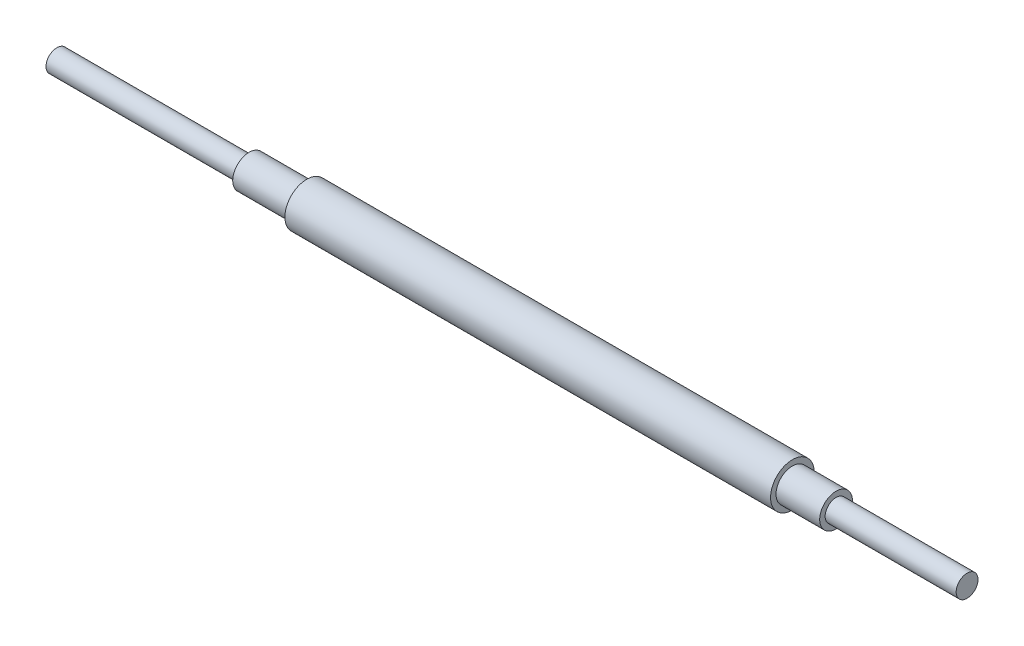
ISO-10303-21;
HEADER;
FILE_DESCRIPTION(('STEP AP214'),'2;1');
FILE_NAME('part.step','',(''),(''),'','','');
FILE_SCHEMA(('AUTOMOTIVE_DESIGN { 1 0 10303 214 1 1 1 1 }'));
ENDSEC;
DATA;
#1=APPLICATION_CONTEXT('core data for automotive mechanical design processes');
#2=APPLICATION_PROTOCOL_DEFINITION('international standard','automotive_design',2000,#1);
#3=PRODUCT_CONTEXT('',#1,'mechanical');
#4=PRODUCT('Part','Part','',(#3));
#5=PRODUCT_RELATED_PRODUCT_CATEGORY('part','',(#4));
#6=PRODUCT_DEFINITION_FORMATION('','',#4);
#7=PRODUCT_DEFINITION_CONTEXT('part definition',#1,'design');
#8=PRODUCT_DEFINITION('design','',#6,#7);
#9=PRODUCT_DEFINITION_SHAPE('','',#8);
#10=(LENGTH_UNIT() NAMED_UNIT(*) SI_UNIT(.MILLI.,.METRE.));
#11=(NAMED_UNIT(*) PLANE_ANGLE_UNIT() SI_UNIT($,.RADIAN.));
#12=(NAMED_UNIT(*) SI_UNIT($,.STERADIAN.) SOLID_ANGLE_UNIT());
#13=UNCERTAINTY_MEASURE_WITH_UNIT(LENGTH_MEASURE(1.E-05),#10,'distance_accuracy_value','');
#14=(GEOMETRIC_REPRESENTATION_CONTEXT(3) GLOBAL_UNCERTAINTY_ASSIGNED_CONTEXT((#13)) GLOBAL_UNIT_ASSIGNED_CONTEXT((#10,
#11,#12)) REPRESENTATION_CONTEXT('',''));
#15=CARTESIAN_POINT('',(0.,0.,0.));
#16=DIRECTION('',(0.,0.,1.));
#17=DIRECTION('',(1.,0.,0.));
#18=AXIS2_PLACEMENT_3D('',#15,#16,#17);
#19=CARTESIAN_POINT('',(-264.055553454714,3.17499999999999,0.));
#20=DIRECTION('',(1.,0.,0.));
#21=DIRECTION('',(0.,1.,0.));
#22=AXIS2_PLACEMENT_3D('',#19,#20,#21);
#23=PLANE('',#22);
#24=CARTESIAN_POINT('',(-264.055553454714,0.,0.));
#25=DIRECTION('',(-1.,0.,0.));
#26=DIRECTION('',(0.,-1.,0.));
#27=AXIS2_PLACEMENT_3D('',#24,#25,#26);
#28=CIRCLE('',#27,3.17499999999999);
#29=CARTESIAN_POINT('',(-264.055553454714,-3.17499999999999,0.));
#30=VERTEX_POINT('',#29);
#31=EDGE_CURVE('E10',#30,#30,#28,.T.);
#32=ORIENTED_EDGE('',*,*,#31,.T.);
#33=EDGE_LOOP('',(#32));
#34=FACE_BOUND('',#33,.T.);
#35=ADVANCED_FACE('F41',(#34),#23,.F.);
#36=CARTESIAN_POINT('',(-264.055553454714,0.,0.));
#37=DIRECTION('',(-1.,0.,0.));
#38=DIRECTION('',(0.,-1.,0.));
#39=AXIS2_PLACEMENT_3D('',#36,#37,#38);
#40=CYLINDRICAL_SURFACE('',#39,3.175);
#41=ORIENTED_EDGE('',*,*,#31,.F.);
#42=EDGE_LOOP('',(#41));
#43=FACE_BOUND('',#42,.T.);
#44=CARTESIAN_POINT('',(-208.175553454714,0.,0.));
#45=DIRECTION('',(-1.,0.,0.));
#46=DIRECTION('',(0.,-1.,0.));
#47=AXIS2_PLACEMENT_3D('',#44,#45,#46);
#48=CIRCLE('',#47,3.175);
#49=CARTESIAN_POINT('',(-208.175553454714,-3.175,0.));
#50=VERTEX_POINT('',#49);
#51=EDGE_CURVE('E48',#50,#50,#48,.T.);
#52=ORIENTED_EDGE('',*,*,#51,.T.);
#53=EDGE_LOOP('',(#52));
#54=FACE_BOUND('',#53,.T.);
#55=ADVANCED_FACE('F107',(#43,#54),#40,.T.);
#56=CARTESIAN_POINT('',(-208.175553454714,4.76249999999998,0.));
#57=DIRECTION('',(1.,0.,0.));
#58=DIRECTION('',(0.,1.,0.));
#59=AXIS2_PLACEMENT_3D('',#56,#57,#58);
#60=PLANE('',#59);
#61=ORIENTED_EDGE('',*,*,#51,.F.);
#62=EDGE_LOOP('',(#61));
#63=FACE_BOUND('',#62,.T.);
#64=CARTESIAN_POINT('',(-208.175553454714,0.,0.));
#65=DIRECTION('',(-1.,0.,0.));
#66=DIRECTION('',(0.,-1.,0.));
#67=AXIS2_PLACEMENT_3D('',#64,#65,#66);
#68=CIRCLE('',#67,4.76249999999998);
#69=CARTESIAN_POINT('',(-208.175553454714,-4.76249999999998,0.));
#70=VERTEX_POINT('',#69);
#71=EDGE_CURVE('E55',#70,#70,#68,.T.);
#72=ORIENTED_EDGE('',*,*,#71,.T.);
#73=EDGE_LOOP('',(#72));
#74=FACE_BOUND('',#73,.T.);
#75=ADVANCED_FACE('F111',(#63,#74),#60,.F.);
#76=CARTESIAN_POINT('',(-264.055553454714,0.,0.));
#77=DIRECTION('',(-1.,0.,0.));
#78=DIRECTION('',(0.,-1.,0.));
#79=AXIS2_PLACEMENT_3D('',#76,#77,#78);
#80=CYLINDRICAL_SURFACE('',#79,4.76249999999998);
#81=ORIENTED_EDGE('',*,*,#71,.F.);
#82=EDGE_LOOP('',(#81));
#83=FACE_BOUND('',#82,.T.);
#84=CARTESIAN_POINT('',(-191.411553454714,0.,0.));
#85=DIRECTION('',(-1.,0.,0.));
#86=DIRECTION('',(0.,-1.,0.));
#87=AXIS2_PLACEMENT_3D('',#84,#85,#86);
#88=CIRCLE('',#87,4.76249999999998);
#89=CARTESIAN_POINT('',(-191.411553454714,-4.76249999999998,0.));
#90=VERTEX_POINT('',#89);
#91=EDGE_CURVE('E62',#90,#90,#88,.T.);
#92=ORIENTED_EDGE('',*,*,#91,.T.);
#93=EDGE_LOOP('',(#92));
#94=FACE_BOUND('',#93,.T.);
#95=ADVANCED_FACE('F116',(#83,#94),#80,.T.);
#96=CARTESIAN_POINT('',(-191.411553454714,6.35,0.));
#97=DIRECTION('',(1.,0.,0.));
#98=DIRECTION('',(0.,1.,0.));
#99=AXIS2_PLACEMENT_3D('',#96,#97,#98);
#100=PLANE('',#99);
#101=ORIENTED_EDGE('',*,*,#91,.F.);
#102=EDGE_LOOP('',(#101));
#103=FACE_BOUND('',#102,.T.);
#104=CARTESIAN_POINT('',(-191.411553454714,0.,0.));
#105=DIRECTION('',(-1.,0.,0.));
#106=DIRECTION('',(0.,-1.,0.));
#107=AXIS2_PLACEMENT_3D('',#104,#105,#106);
#108=CIRCLE('',#107,6.35);
#109=CARTESIAN_POINT('',(-191.411553454714,-6.35,0.));
#110=VERTEX_POINT('',#109);
#111=EDGE_CURVE('E68',#110,#110,#108,.T.);
#112=ORIENTED_EDGE('',*,*,#111,.T.);
#113=EDGE_LOOP('',(#112));
#114=FACE_BOUND('',#113,.T.);
#115=ADVANCED_FACE('F122',(#103,#114),#100,.F.);
#116=CARTESIAN_POINT('',(-264.055553454714,0.,0.));
#117=DIRECTION('',(-1.,0.,0.));
#118=DIRECTION('',(0.,-1.,0.));
#119=AXIS2_PLACEMENT_3D('',#116,#117,#118);
#120=CYLINDRICAL_SURFACE('',#119,6.35);
#121=ORIENTED_EDGE('',*,*,#111,.F.);
#122=EDGE_LOOP('',(#121));
#123=FACE_BOUND('',#122,.T.);
#124=CARTESIAN_POINT('',(-50.1875534547145,0.,0.));
#125=DIRECTION('',(-1.,0.,0.));
#126=DIRECTION('',(0.,-1.,0.));
#127=AXIS2_PLACEMENT_3D('',#124,#125,#126);
#128=CIRCLE('',#127,6.35);
#129=CARTESIAN_POINT('',(-50.1875534547145,-6.35,0.));
#130=VERTEX_POINT('',#129);
#131=EDGE_CURVE('E72',#130,#130,#128,.T.);
#132=ORIENTED_EDGE('',*,*,#131,.T.);
#133=EDGE_LOOP('',(#132));
#134=FACE_BOUND('',#133,.T.);
#135=ADVANCED_FACE('F126',(#123,#134),#120,.T.);
#136=CARTESIAN_POINT('',(-50.1875534547145,4.7625,0.));
#137=DIRECTION('',(-1.,0.,0.));
#138=DIRECTION('',(0.,-1.,0.));
#139=AXIS2_PLACEMENT_3D('',#136,#137,#138);
#140=PLANE('',#139);
#141=ORIENTED_EDGE('',*,*,#131,.F.);
#142=EDGE_LOOP('',(#141));
#143=FACE_BOUND('',#142,.T.);
#144=CARTESIAN_POINT('',(-50.1875534547145,0.,0.));
#145=DIRECTION('',(-1.,0.,0.));
#146=DIRECTION('',(0.,-1.,0.));
#147=AXIS2_PLACEMENT_3D('',#144,#145,#146);
#148=CIRCLE('',#147,4.7625);
#149=CARTESIAN_POINT('',(-50.1875534547145,-4.7625,0.));
#150=VERTEX_POINT('',#149);
#151=EDGE_CURVE('E76',#150,#150,#148,.T.);
#152=ORIENTED_EDGE('',*,*,#151,.T.);
#153=EDGE_LOOP('',(#152));
#154=FACE_BOUND('',#153,.T.);
#155=ADVANCED_FACE('F130',(#143,#154),#140,.F.);
#156=CARTESIAN_POINT('',(-264.055553454714,0.,0.));
#157=DIRECTION('',(-1.,0.,0.));
#158=DIRECTION('',(0.,-1.,0.));
#159=AXIS2_PLACEMENT_3D('',#156,#157,#158);
#160=CYLINDRICAL_SURFACE('',#159,4.7625);
#161=ORIENTED_EDGE('',*,*,#151,.F.);
#162=EDGE_LOOP('',(#161));
#163=FACE_BOUND('',#162,.T.);
#164=CARTESIAN_POINT('',(-37.4875534547145,0.,0.));
#165=DIRECTION('',(-1.,0.,0.));
#166=DIRECTION('',(0.,-1.,0.));
#167=AXIS2_PLACEMENT_3D('',#164,#165,#166);
#168=CIRCLE('',#167,4.7625);
#169=CARTESIAN_POINT('',(-37.4875534547145,-4.7625,0.));
#170=VERTEX_POINT('',#169);
#171=EDGE_CURVE('E80',#170,#170,#168,.T.);
#172=ORIENTED_EDGE('',*,*,#171,.T.);
#173=EDGE_LOOP('',(#172));
#174=FACE_BOUND('',#173,.T.);
#175=ADVANCED_FACE('F134',(#163,#174),#160,.T.);
#176=CARTESIAN_POINT('',(-37.4875534547145,3.17499999999999,0.));
#177=DIRECTION('',(-1.,0.,0.));
#178=DIRECTION('',(0.,-1.,0.));
#179=AXIS2_PLACEMENT_3D('',#176,#177,#178);
#180=PLANE('',#179);
#181=ORIENTED_EDGE('',*,*,#171,.F.);
#182=EDGE_LOOP('',(#181));
#183=FACE_BOUND('',#182,.T.);
#184=CARTESIAN_POINT('',(-37.4875534547145,0.,0.));
#185=DIRECTION('',(-1.,0.,0.));
#186=DIRECTION('',(0.,-1.,0.));
#187=AXIS2_PLACEMENT_3D('',#184,#185,#186);
#188=CIRCLE('',#187,3.17499999999999);
#189=CARTESIAN_POINT('',(-37.4875534547145,-3.17499999999999,0.));
#190=VERTEX_POINT('',#189);
#191=EDGE_CURVE('E84',#190,#190,#188,.T.);
#192=ORIENTED_EDGE('',*,*,#191,.T.);
#193=EDGE_LOOP('',(#192));
#194=FACE_BOUND('',#193,.T.);
#195=ADVANCED_FACE('F103',(#183,#194),#180,.F.);
#196=CARTESIAN_POINT('',(-264.055553454714,0.,0.));
#197=DIRECTION('',(-1.,0.,0.));
#198=DIRECTION('',(0.,-1.,0.));
#199=AXIS2_PLACEMENT_3D('',#196,#197,#198);
#200=CYLINDRICAL_SURFACE('',#199,3.175);
#201=ORIENTED_EDGE('',*,*,#191,.F.);
#202=EDGE_LOOP('',(#201));
#203=FACE_BOUND('',#202,.T.);
#204=CARTESIAN_POINT('',(0.612446545285528,0.,0.));
#205=DIRECTION('',(-1.,0.,0.));
#206=DIRECTION('',(0.,-1.,0.));
#207=AXIS2_PLACEMENT_3D('',#204,#205,#206);
#208=CIRCLE('',#207,3.175);
#209=CARTESIAN_POINT('',(0.612446545285528,-3.175,0.));
#210=VERTEX_POINT('',#209);
#211=EDGE_CURVE('E88',#210,#210,#208,.T.);
#212=ORIENTED_EDGE('',*,*,#211,.T.);
#213=EDGE_LOOP('',(#212));
#214=FACE_BOUND('',#213,.T.);
#215=ADVANCED_FACE('F95',(#203,#214),#200,.T.);
#216=CARTESIAN_POINT('',(0.612446545285521,3.175,0.));
#217=DIRECTION('',(-1.,0.,0.));
#218=DIRECTION('',(0.,-1.,0.));
#219=AXIS2_PLACEMENT_3D('',#216,#217,#218);
#220=PLANE('',#219);
#221=ORIENTED_EDGE('',*,*,#211,.F.);
#222=EDGE_LOOP('',(#221));
#223=FACE_BOUND('',#222,.T.);
#224=ADVANCED_FACE('F97',(#223),#220,.F.);
#225=CLOSED_SHELL('',(#35,#55,#75,#95,#115,#135,#155,#175,#195,#215,#224));
#226=MANIFOLD_SOLID_BREP('B2',#225);
#227=ADVANCED_BREP_SHAPE_REPRESENTATION('',(#18,#226),#14);
#228=SHAPE_DEFINITION_REPRESENTATION(#9,#227);
ENDSEC;
END-ISO-10303-21;
